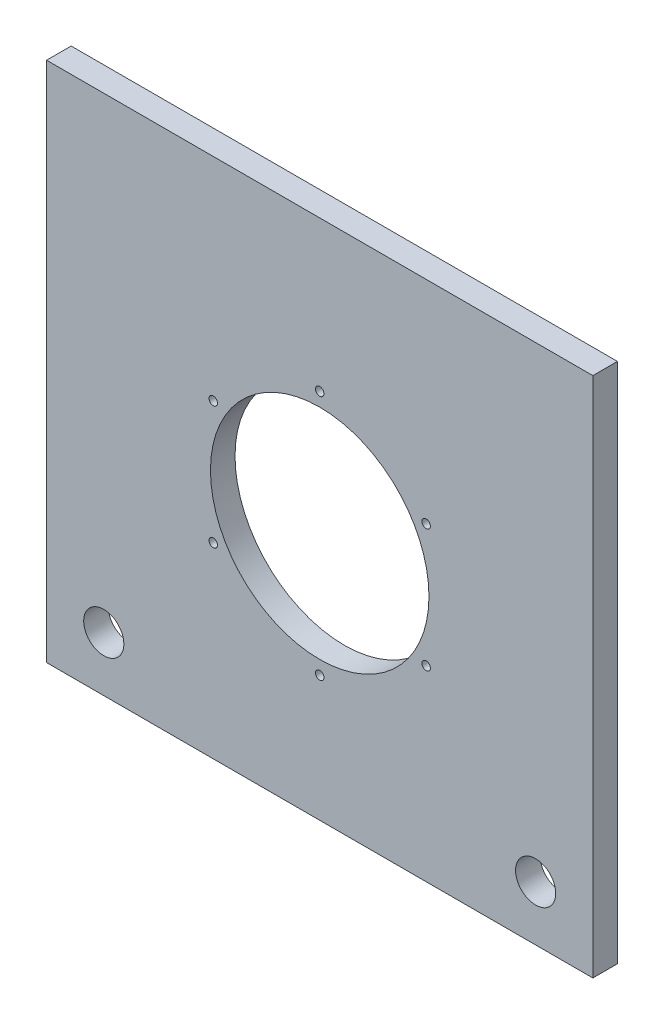
ISO-10303-21;
HEADER;
FILE_DESCRIPTION(('STEP AP214'),'2;1');
FILE_NAME('part.step','',(''),(''),'','','');
FILE_SCHEMA(('AUTOMOTIVE_DESIGN { 1 0 10303 214 1 1 1 1 }'));
ENDSEC;
DATA;
#1=APPLICATION_CONTEXT('core data for automotive mechanical design processes');
#2=APPLICATION_PROTOCOL_DEFINITION('international standard','automotive_design',2000,#1);
#3=PRODUCT_CONTEXT('',#1,'mechanical');
#4=PRODUCT('Part','Part','',(#3));
#5=PRODUCT_RELATED_PRODUCT_CATEGORY('part','',(#4));
#6=PRODUCT_DEFINITION_FORMATION('','',#4);
#7=PRODUCT_DEFINITION_CONTEXT('part definition',#1,'design');
#8=PRODUCT_DEFINITION('design','',#6,#7);
#9=PRODUCT_DEFINITION_SHAPE('','',#8);
#10=(LENGTH_UNIT() NAMED_UNIT(*) SI_UNIT(.MILLI.,.METRE.));
#11=(NAMED_UNIT(*) PLANE_ANGLE_UNIT() SI_UNIT($,.RADIAN.));
#12=(NAMED_UNIT(*) SI_UNIT($,.STERADIAN.) SOLID_ANGLE_UNIT());
#13=UNCERTAINTY_MEASURE_WITH_UNIT(LENGTH_MEASURE(1.E-05),#10,'distance_accuracy_value','');
#14=(GEOMETRIC_REPRESENTATION_CONTEXT(3) GLOBAL_UNCERTAINTY_ASSIGNED_CONTEXT((#13)) GLOBAL_UNIT_ASSIGNED_CONTEXT((#10,
#11,#12)) REPRESENTATION_CONTEXT('',''));
#15=CARTESIAN_POINT('',(0.,0.,0.));
#16=DIRECTION('',(0.,0.,1.));
#17=DIRECTION('',(1.,0.,0.));
#18=AXIS2_PLACEMENT_3D('',#15,#16,#17);
#19=CARTESIAN_POINT('',(0.,0.,9.));
#20=DIRECTION('',(0.,0.,1.));
#21=DIRECTION('',(1.,0.,0.));
#22=AXIS2_PLACEMENT_3D('',#19,#20,#21);
#23=PLANE('',#22);
#24=CARTESIAN_POINT('',(-38.9711431702997,-27.,9.));
#25=DIRECTION('',(0.,0.,1.));
#26=DIRECTION('',(1.,0.,0.));
#27=AXIS2_PLACEMENT_3D('',#24,#25,#26);
#28=CIRCLE('',#27,1.54999999999999);
#29=CARTESIAN_POINT('',(-37.4211431702997,-27.,9.));
#30=VERTEX_POINT('',#29);
#31=EDGE_CURVE('E159',#30,#30,#28,.T.);
#32=ORIENTED_EDGE('',*,*,#31,.F.);
#33=EDGE_LOOP('',(#32));
#34=FACE_BOUND('',#33,.T.);
#35=CARTESIAN_POINT('',(38.9711431702997,-27.,9.));
#36=DIRECTION('',(0.,0.,1.));
#37=DIRECTION('',(1.,0.,0.));
#38=AXIS2_PLACEMENT_3D('',#35,#36,#37);
#39=CIRCLE('',#38,1.54999999999999);
#40=CARTESIAN_POINT('',(40.5211431702997,-27.,9.));
#41=VERTEX_POINT('',#40);
#42=EDGE_CURVE('E147',#41,#41,#39,.T.);
#43=ORIENTED_EDGE('',*,*,#42,.F.);
#44=EDGE_LOOP('',(#43));
#45=FACE_BOUND('',#44,.T.);
#46=CARTESIAN_POINT('',(0.,40.5,9.));
#47=DIRECTION('',(0.,0.,1.));
#48=DIRECTION('',(1.,0.,0.));
#49=AXIS2_PLACEMENT_3D('',#46,#47,#48);
#50=CIRCLE('',#49,1.55);
#51=CARTESIAN_POINT('',(1.55,40.5,9.));
#52=VERTEX_POINT('',#51);
#53=EDGE_CURVE('E135',#52,#52,#50,.T.);
#54=ORIENTED_EDGE('',*,*,#53,.F.);
#55=EDGE_LOOP('',(#54));
#56=FACE_BOUND('',#55,.T.);
#57=CARTESIAN_POINT('',(-79.0575916230366,-75.5,9.));
#58=DIRECTION('',(0.,0.,1.));
#59=DIRECTION('',(1.,0.,0.));
#60=AXIS2_PLACEMENT_3D('',#57,#58,#59);
#61=CIRCLE('',#60,7.34999999999999);
#62=CARTESIAN_POINT('',(-71.7075916230366,-75.5,9.));
#63=VERTEX_POINT('',#62);
#64=EDGE_CURVE('E123',#63,#63,#61,.T.);
#65=ORIENTED_EDGE('',*,*,#64,.F.);
#66=EDGE_LOOP('',(#65));
#67=FACE_BOUND('',#66,.T.);
#68=DIRECTION('',(0.,1.,0.));
#69=VECTOR('',#68,1.);
#70=CARTESIAN_POINT('',(100.,95.5,9.));
#71=LINE('',#70,#69);
#72=CARTESIAN_POINT('',(100.,-95.5,9.));
#73=VERTEX_POINT('',#72);
#74=CARTESIAN_POINT('',(100.,95.5,9.));
#75=VERTEX_POINT('',#74);
#76=EDGE_CURVE('E93',#73,#75,#71,.T.);
#77=ORIENTED_EDGE('',*,*,#76,.T.);
#78=DIRECTION('',(-1.,0.,0.));
#79=VECTOR('',#78,1.);
#80=CARTESIAN_POINT('',(-100.,95.5,9.));
#81=LINE('',#80,#79);
#82=CARTESIAN_POINT('',(-100.,95.5,9.));
#83=VERTEX_POINT('',#82);
#84=EDGE_CURVE('E88',#75,#83,#81,.T.);
#85=ORIENTED_EDGE('',*,*,#84,.T.);
#86=DIRECTION('',(0.,-1.,0.));
#87=VECTOR('',#86,1.);
#88=CARTESIAN_POINT('',(-100.,95.5,9.));
#89=LINE('',#88,#87);
#90=CARTESIAN_POINT('',(-100.,-95.5,9.));
#91=VERTEX_POINT('',#90);
#92=EDGE_CURVE('E91',#83,#91,#89,.T.);
#93=ORIENTED_EDGE('',*,*,#92,.T.);
#94=DIRECTION('',(1.,0.,0.));
#95=VECTOR('',#94,1.);
#96=CARTESIAN_POINT('',(-100.,-95.5,9.));
#97=LINE('',#96,#95);
#98=EDGE_CURVE('E58',#91,#73,#97,.T.);
#99=ORIENTED_EDGE('',*,*,#98,.T.);
#100=EDGE_LOOP('',(#77,#85,#93,#99));
#101=FACE_BOUND('',#100,.T.);
#102=CARTESIAN_POINT('',(0.,-4.5,9.));
#103=DIRECTION('',(0.,0.,1.));
#104=DIRECTION('',(1.,0.,0.));
#105=AXIS2_PLACEMENT_3D('',#102,#103,#104);
#106=CIRCLE('',#105,40.);
#107=CARTESIAN_POINT('',(40.,-4.5,9.));
#108=VERTEX_POINT('',#107);
#109=EDGE_CURVE('E108',#108,#108,#106,.T.);
#110=ORIENTED_EDGE('',*,*,#109,.F.);
#111=EDGE_LOOP('',(#110));
#112=FACE_BOUND('',#111,.T.);
#113=CARTESIAN_POINT('',(79.0575916230372,-75.4999999999996,9.));
#114=DIRECTION('',(0.,0.,1.));
#115=DIRECTION('',(-1.,0.,0.));
#116=AXIS2_PLACEMENT_3D('',#113,#114,#115);
#117=CIRCLE('',#116,7.34999999999999);
#118=CARTESIAN_POINT('',(71.7075916230372,-75.4999999999996,9.));
#119=VERTEX_POINT('',#118);
#120=EDGE_CURVE('E129',#119,#119,#117,.T.);
#121=ORIENTED_EDGE('',*,*,#120,.F.);
#122=EDGE_LOOP('',(#121));
#123=FACE_BOUND('',#122,.T.);
#124=CARTESIAN_POINT('',(38.9711431702997,18.,9.));
#125=DIRECTION('',(0.,0.,1.));
#126=DIRECTION('',(1.,0.,0.));
#127=AXIS2_PLACEMENT_3D('',#124,#125,#126);
#128=CIRCLE('',#127,1.55000000000001);
#129=CARTESIAN_POINT('',(40.5211431702998,18.,9.));
#130=VERTEX_POINT('',#129);
#131=EDGE_CURVE('E141',#130,#130,#128,.T.);
#132=ORIENTED_EDGE('',*,*,#131,.F.);
#133=EDGE_LOOP('',(#132));
#134=FACE_BOUND('',#133,.T.);
#135=CARTESIAN_POINT('',(0.,-49.5,9.));
#136=DIRECTION('',(0.,0.,1.));
#137=DIRECTION('',(1.,0.,0.));
#138=AXIS2_PLACEMENT_3D('',#135,#136,#137);
#139=CIRCLE('',#138,1.55);
#140=CARTESIAN_POINT('',(1.55000000000001,-49.5,9.));
#141=VERTEX_POINT('',#140);
#142=EDGE_CURVE('E153',#141,#141,#139,.T.);
#143=ORIENTED_EDGE('',*,*,#142,.F.);
#144=EDGE_LOOP('',(#143));
#145=FACE_BOUND('',#144,.T.);
#146=CARTESIAN_POINT('',(-38.9711431702997,18.,9.));
#147=DIRECTION('',(0.,0.,1.));
#148=DIRECTION('',(1.,0.,0.));
#149=AXIS2_PLACEMENT_3D('',#146,#147,#148);
#150=CIRCLE('',#149,1.55);
#151=CARTESIAN_POINT('',(-37.4211431702997,18.,9.));
#152=VERTEX_POINT('',#151);
#153=EDGE_CURVE('E165',#152,#152,#150,.T.);
#154=ORIENTED_EDGE('',*,*,#153,.F.);
#155=EDGE_LOOP('',(#154));
#156=FACE_BOUND('',#155,.T.);
#157=ADVANCED_FACE('F41',(#34,#45,#56,#67,#101,#112,#123,#134,#145,#156),#23,.T.);
#158=CARTESIAN_POINT('',(0.,0.,0.));
#159=DIRECTION('',(0.,0.,1.));
#160=DIRECTION('',(1.,0.,0.));
#161=AXIS2_PLACEMENT_3D('',#158,#159,#160);
#162=PLANE('',#161);
#163=DIRECTION('',(0.,1.,0.));
#164=VECTOR('',#163,1.);
#165=CARTESIAN_POINT('',(100.,95.5,0.));
#166=LINE('',#165,#164);
#167=CARTESIAN_POINT('',(100.,-95.5,0.));
#168=VERTEX_POINT('',#167);
#169=CARTESIAN_POINT('',(100.,95.5,0.));
#170=VERTEX_POINT('',#169);
#171=EDGE_CURVE('E105',#168,#170,#166,.T.);
#172=ORIENTED_EDGE('',*,*,#171,.F.);
#173=DIRECTION('',(1.,0.,0.));
#174=VECTOR('',#173,1.);
#175=CARTESIAN_POINT('',(-100.,-95.5,0.));
#176=LINE('',#175,#174);
#177=CARTESIAN_POINT('',(-100.,-95.5,0.));
#178=VERTEX_POINT('',#177);
#179=EDGE_CURVE('E81',#178,#168,#176,.T.);
#180=ORIENTED_EDGE('',*,*,#179,.F.);
#181=DIRECTION('',(0.,-1.,0.));
#182=VECTOR('',#181,1.);
#183=CARTESIAN_POINT('',(-100.,95.5,0.));
#184=LINE('',#183,#182);
#185=CARTESIAN_POINT('',(-100.,95.5,0.));
#186=VERTEX_POINT('',#185);
#187=EDGE_CURVE('E75',#186,#178,#184,.T.);
#188=ORIENTED_EDGE('',*,*,#187,.F.);
#189=DIRECTION('',(-1.,0.,0.));
#190=VECTOR('',#189,1.);
#191=CARTESIAN_POINT('',(-100.,95.5,0.));
#192=LINE('',#191,#190);
#193=EDGE_CURVE('E97',#170,#186,#192,.T.);
#194=ORIENTED_EDGE('',*,*,#193,.F.);
#195=EDGE_LOOP('',(#172,#180,#188,#194));
#196=FACE_BOUND('',#195,.T.);
#197=CARTESIAN_POINT('',(0.,-4.5,0.));
#198=DIRECTION('',(0.,0.,1.));
#199=DIRECTION('',(1.,0.,0.));
#200=AXIS2_PLACEMENT_3D('',#197,#198,#199);
#201=CIRCLE('',#200,40.);
#202=CARTESIAN_POINT('',(40.,-4.5,0.));
#203=VERTEX_POINT('',#202);
#204=EDGE_CURVE('E120',#203,#203,#201,.T.);
#205=ORIENTED_EDGE('',*,*,#204,.T.);
#206=EDGE_LOOP('',(#205));
#207=FACE_BOUND('',#206,.T.);
#208=CARTESIAN_POINT('',(-79.0575916230366,-75.5,0.));
#209=DIRECTION('',(0.,0.,1.));
#210=DIRECTION('',(1.,0.,0.));
#211=AXIS2_PLACEMENT_3D('',#208,#209,#210);
#212=CIRCLE('',#211,7.34999999999999);
#213=CARTESIAN_POINT('',(-71.7075916230366,-75.5,0.));
#214=VERTEX_POINT('',#213);
#215=EDGE_CURVE('E126',#214,#214,#212,.T.);
#216=ORIENTED_EDGE('',*,*,#215,.T.);
#217=EDGE_LOOP('',(#216));
#218=FACE_BOUND('',#217,.T.);
#219=CARTESIAN_POINT('',(79.0575916230372,-75.4999999999996,0.));
#220=DIRECTION('',(0.,0.,1.));
#221=DIRECTION('',(-1.,0.,0.));
#222=AXIS2_PLACEMENT_3D('',#219,#220,#221);
#223=CIRCLE('',#222,7.34999999999999);
#224=CARTESIAN_POINT('',(71.7075916230372,-75.4999999999996,0.));
#225=VERTEX_POINT('',#224);
#226=EDGE_CURVE('E132',#225,#225,#223,.T.);
#227=ORIENTED_EDGE('',*,*,#226,.T.);
#228=EDGE_LOOP('',(#227));
#229=FACE_BOUND('',#228,.T.);
#230=CARTESIAN_POINT('',(0.,40.5,0.));
#231=DIRECTION('',(0.,0.,1.));
#232=DIRECTION('',(1.,0.,0.));
#233=AXIS2_PLACEMENT_3D('',#230,#231,#232);
#234=CIRCLE('',#233,1.55);
#235=CARTESIAN_POINT('',(1.55,40.5,0.));
#236=VERTEX_POINT('',#235);
#237=EDGE_CURVE('E138',#236,#236,#234,.T.);
#238=ORIENTED_EDGE('',*,*,#237,.T.);
#239=EDGE_LOOP('',(#238));
#240=FACE_BOUND('',#239,.T.);
#241=CARTESIAN_POINT('',(38.9711431702997,18.,0.));
#242=DIRECTION('',(0.,0.,1.));
#243=DIRECTION('',(1.,0.,0.));
#244=AXIS2_PLACEMENT_3D('',#241,#242,#243);
#245=CIRCLE('',#244,1.55000000000001);
#246=CARTESIAN_POINT('',(40.5211431702998,18.,0.));
#247=VERTEX_POINT('',#246);
#248=EDGE_CURVE('E144',#247,#247,#245,.T.);
#249=ORIENTED_EDGE('',*,*,#248,.T.);
#250=EDGE_LOOP('',(#249));
#251=FACE_BOUND('',#250,.T.);
#252=CARTESIAN_POINT('',(38.9711431702997,-27.,0.));
#253=DIRECTION('',(0.,0.,1.));
#254=DIRECTION('',(1.,0.,0.));
#255=AXIS2_PLACEMENT_3D('',#252,#253,#254);
#256=CIRCLE('',#255,1.54999999999999);
#257=CARTESIAN_POINT('',(40.5211431702997,-27.,0.));
#258=VERTEX_POINT('',#257);
#259=EDGE_CURVE('E150',#258,#258,#256,.T.);
#260=ORIENTED_EDGE('',*,*,#259,.T.);
#261=EDGE_LOOP('',(#260));
#262=FACE_BOUND('',#261,.T.);
#263=CARTESIAN_POINT('',(0.,-49.5,0.));
#264=DIRECTION('',(0.,0.,1.));
#265=DIRECTION('',(1.,0.,0.));
#266=AXIS2_PLACEMENT_3D('',#263,#264,#265);
#267=CIRCLE('',#266,1.55);
#268=CARTESIAN_POINT('',(1.55000000000001,-49.5,0.));
#269=VERTEX_POINT('',#268);
#270=EDGE_CURVE('E156',#269,#269,#267,.T.);
#271=ORIENTED_EDGE('',*,*,#270,.T.);
#272=EDGE_LOOP('',(#271));
#273=FACE_BOUND('',#272,.T.);
#274=CARTESIAN_POINT('',(-38.9711431702997,-27.,0.));
#275=DIRECTION('',(0.,0.,1.));
#276=DIRECTION('',(1.,0.,0.));
#277=AXIS2_PLACEMENT_3D('',#274,#275,#276);
#278=CIRCLE('',#277,1.54999999999999);
#279=CARTESIAN_POINT('',(-37.4211431702997,-27.,0.));
#280=VERTEX_POINT('',#279);
#281=EDGE_CURVE('E162',#280,#280,#278,.T.);
#282=ORIENTED_EDGE('',*,*,#281,.T.);
#283=EDGE_LOOP('',(#282));
#284=FACE_BOUND('',#283,.T.);
#285=CARTESIAN_POINT('',(-38.9711431702997,18.,0.));
#286=DIRECTION('',(0.,0.,1.));
#287=DIRECTION('',(1.,0.,0.));
#288=AXIS2_PLACEMENT_3D('',#285,#286,#287);
#289=CIRCLE('',#288,1.55);
#290=CARTESIAN_POINT('',(-37.4211431702997,18.,0.));
#291=VERTEX_POINT('',#290);
#292=EDGE_CURVE('E168',#291,#291,#289,.T.);
#293=ORIENTED_EDGE('',*,*,#292,.T.);
#294=EDGE_LOOP('',(#293));
#295=FACE_BOUND('',#294,.T.);
#296=ADVANCED_FACE('F116',(#196,#207,#218,#229,#240,#251,#262,#273,#284,#295),#162,.F.);
#297=CARTESIAN_POINT('',(100.,95.5,9.));
#298=DIRECTION('',(-1.,0.,0.));
#299=DIRECTION('',(0.,-1.,0.));
#300=AXIS2_PLACEMENT_3D('',#297,#298,#299);
#301=PLANE('',#300);
#302=ORIENTED_EDGE('',*,*,#171,.T.);
#303=DIRECTION('',(0.,0.,-1.));
#304=VECTOR('',#303,1.);
#305=CARTESIAN_POINT('',(100.,95.5,9.));
#306=LINE('',#305,#304);
#307=EDGE_CURVE('E11',#75,#170,#306,.T.);
#308=ORIENTED_EDGE('',*,*,#307,.F.);
#309=ORIENTED_EDGE('',*,*,#76,.F.);
#310=DIRECTION('',(0.,0.,-1.));
#311=VECTOR('',#310,1.);
#312=CARTESIAN_POINT('',(100.,-95.5,9.));
#313=LINE('',#312,#311);
#314=EDGE_CURVE('E101',#73,#168,#313,.T.);
#315=ORIENTED_EDGE('',*,*,#314,.T.);
#316=EDGE_LOOP('',(#302,#308,#309,#315));
#317=FACE_BOUND('',#316,.T.);
#318=ADVANCED_FACE('F43',(#317),#301,.F.);
#319=CARTESIAN_POINT('',(-100.,95.5,9.));
#320=DIRECTION('',(0.,-1.,0.));
#321=DIRECTION('',(0.,0.,-1.));
#322=AXIS2_PLACEMENT_3D('',#319,#320,#321);
#323=PLANE('',#322);
#324=ORIENTED_EDGE('',*,*,#193,.T.);
#325=DIRECTION('',(0.,0.,-1.));
#326=VECTOR('',#325,1.);
#327=CARTESIAN_POINT('',(-100.,95.5,9.));
#328=LINE('',#327,#326);
#329=EDGE_CURVE('E50',#83,#186,#328,.T.);
#330=ORIENTED_EDGE('',*,*,#329,.F.);
#331=ORIENTED_EDGE('',*,*,#84,.F.);
#332=ORIENTED_EDGE('',*,*,#307,.T.);
#333=EDGE_LOOP('',(#324,#330,#331,#332));
#334=FACE_BOUND('',#333,.T.);
#335=ADVANCED_FACE('F96',(#334),#323,.F.);
#336=CARTESIAN_POINT('',(-100.,95.5,9.));
#337=DIRECTION('',(1.,0.,0.));
#338=DIRECTION('',(0.,1.,0.));
#339=AXIS2_PLACEMENT_3D('',#336,#337,#338);
#340=PLANE('',#339);
#341=ORIENTED_EDGE('',*,*,#187,.T.);
#342=DIRECTION('',(0.,0.,-1.));
#343=VECTOR('',#342,1.);
#344=CARTESIAN_POINT('',(-100.,-95.5,9.));
#345=LINE('',#344,#343);
#346=EDGE_CURVE('E98',#91,#178,#345,.T.);
#347=ORIENTED_EDGE('',*,*,#346,.F.);
#348=ORIENTED_EDGE('',*,*,#92,.F.);
#349=ORIENTED_EDGE('',*,*,#329,.T.);
#350=EDGE_LOOP('',(#341,#347,#348,#349));
#351=FACE_BOUND('',#350,.T.);
#352=ADVANCED_FACE('F99',(#351),#340,.F.);
#353=CARTESIAN_POINT('',(-100.,-95.5,9.));
#354=DIRECTION('',(0.,1.,0.));
#355=DIRECTION('',(0.,0.,1.));
#356=AXIS2_PLACEMENT_3D('',#353,#354,#355);
#357=PLANE('',#356);
#358=ORIENTED_EDGE('',*,*,#179,.T.);
#359=ORIENTED_EDGE('',*,*,#314,.F.);
#360=ORIENTED_EDGE('',*,*,#98,.F.);
#361=ORIENTED_EDGE('',*,*,#346,.T.);
#362=EDGE_LOOP('',(#358,#359,#360,#361));
#363=FACE_BOUND('',#362,.T.);
#364=ADVANCED_FACE('F113',(#363),#357,.F.);
#365=CARTESIAN_POINT('',(0.,-4.5,9.));
#366=DIRECTION('',(0.,0.,-1.));
#367=DIRECTION('',(-1.,0.,0.));
#368=AXIS2_PLACEMENT_3D('',#365,#366,#367);
#369=CYLINDRICAL_SURFACE('',#368,40.);
#370=ORIENTED_EDGE('',*,*,#109,.T.);
#371=EDGE_LOOP('',(#370));
#372=FACE_BOUND('',#371,.T.);
#373=ORIENTED_EDGE('',*,*,#204,.F.);
#374=EDGE_LOOP('',(#373));
#375=FACE_BOUND('',#374,.T.);
#376=ADVANCED_FACE('F187',(#372,#375),#369,.F.);
#377=CARTESIAN_POINT('',(-79.0575916230366,-75.5,9.));
#378=DIRECTION('',(0.,0.,-1.));
#379=DIRECTION('',(-1.,0.,0.));
#380=AXIS2_PLACEMENT_3D('',#377,#378,#379);
#381=CYLINDRICAL_SURFACE('',#380,7.34999999999999);
#382=ORIENTED_EDGE('',*,*,#64,.T.);
#383=EDGE_LOOP('',(#382));
#384=FACE_BOUND('',#383,.T.);
#385=ORIENTED_EDGE('',*,*,#215,.F.);
#386=EDGE_LOOP('',(#385));
#387=FACE_BOUND('',#386,.T.);
#388=ADVANCED_FACE('F232',(#384,#387),#381,.F.);
#389=CARTESIAN_POINT('',(79.0575916230372,-75.4999999999996,9.));
#390=DIRECTION('',(0.,0.,-1.));
#391=DIRECTION('',(-1.,0.,0.));
#392=AXIS2_PLACEMENT_3D('',#389,#390,#391);
#393=CYLINDRICAL_SURFACE('',#392,7.34999999999999);
#394=ORIENTED_EDGE('',*,*,#120,.T.);
#395=EDGE_LOOP('',(#394));
#396=FACE_BOUND('',#395,.T.);
#397=ORIENTED_EDGE('',*,*,#226,.F.);
#398=EDGE_LOOP('',(#397));
#399=FACE_BOUND('',#398,.T.);
#400=ADVANCED_FACE('F240',(#396,#399),#393,.F.);
#401=CARTESIAN_POINT('',(0.,40.5,9.));
#402=DIRECTION('',(0.,0.,-1.));
#403=DIRECTION('',(-1.,0.,0.));
#404=AXIS2_PLACEMENT_3D('',#401,#402,#403);
#405=CYLINDRICAL_SURFACE('',#404,1.55);
#406=ORIENTED_EDGE('',*,*,#53,.T.);
#407=EDGE_LOOP('',(#406));
#408=FACE_BOUND('',#407,.T.);
#409=ORIENTED_EDGE('',*,*,#237,.F.);
#410=EDGE_LOOP('',(#409));
#411=FACE_BOUND('',#410,.T.);
#412=ADVANCED_FACE('F248',(#408,#411),#405,.F.);
#413=CARTESIAN_POINT('',(38.9711431702997,18.,9.));
#414=DIRECTION('',(0.,0.,-1.));
#415=DIRECTION('',(-1.,0.,0.));
#416=AXIS2_PLACEMENT_3D('',#413,#414,#415);
#417=CYLINDRICAL_SURFACE('',#416,1.55000000000001);
#418=ORIENTED_EDGE('',*,*,#131,.T.);
#419=EDGE_LOOP('',(#418));
#420=FACE_BOUND('',#419,.T.);
#421=ORIENTED_EDGE('',*,*,#248,.F.);
#422=EDGE_LOOP('',(#421));
#423=FACE_BOUND('',#422,.T.);
#424=ADVANCED_FACE('F257',(#420,#423),#417,.F.);
#425=CARTESIAN_POINT('',(38.9711431702997,-27.,9.));
#426=DIRECTION('',(0.,0.,-1.));
#427=DIRECTION('',(-1.,0.,0.));
#428=AXIS2_PLACEMENT_3D('',#425,#426,#427);
#429=CYLINDRICAL_SURFACE('',#428,1.54999999999999);
#430=ORIENTED_EDGE('',*,*,#42,.T.);
#431=EDGE_LOOP('',(#430));
#432=FACE_BOUND('',#431,.T.);
#433=ORIENTED_EDGE('',*,*,#259,.F.);
#434=EDGE_LOOP('',(#433));
#435=FACE_BOUND('',#434,.T.);
#436=ADVANCED_FACE('F266',(#432,#435),#429,.F.);
#437=CARTESIAN_POINT('',(0.,-49.5,9.));
#438=DIRECTION('',(0.,0.,-1.));
#439=DIRECTION('',(-1.,0.,0.));
#440=AXIS2_PLACEMENT_3D('',#437,#438,#439);
#441=CYLINDRICAL_SURFACE('',#440,1.55);
#442=ORIENTED_EDGE('',*,*,#142,.T.);
#443=EDGE_LOOP('',(#442));
#444=FACE_BOUND('',#443,.T.);
#445=ORIENTED_EDGE('',*,*,#270,.F.);
#446=EDGE_LOOP('',(#445));
#447=FACE_BOUND('',#446,.T.);
#448=ADVANCED_FACE('F275',(#444,#447),#441,.F.);
#449=CARTESIAN_POINT('',(-38.9711431702997,-27.,9.));
#450=DIRECTION('',(0.,0.,-1.));
#451=DIRECTION('',(-1.,0.,0.));
#452=AXIS2_PLACEMENT_3D('',#449,#450,#451);
#453=CYLINDRICAL_SURFACE('',#452,1.54999999999999);
#454=ORIENTED_EDGE('',*,*,#31,.T.);
#455=EDGE_LOOP('',(#454));
#456=FACE_BOUND('',#455,.T.);
#457=ORIENTED_EDGE('',*,*,#281,.F.);
#458=EDGE_LOOP('',(#457));
#459=FACE_BOUND('',#458,.T.);
#460=ADVANCED_FACE('F284',(#456,#459),#453,.F.);
#461=CARTESIAN_POINT('',(-38.9711431702997,18.,9.));
#462=DIRECTION('',(0.,0.,-1.));
#463=DIRECTION('',(-1.,0.,0.));
#464=AXIS2_PLACEMENT_3D('',#461,#462,#463);
#465=CYLINDRICAL_SURFACE('',#464,1.55);
#466=ORIENTED_EDGE('',*,*,#153,.T.);
#467=EDGE_LOOP('',(#466));
#468=FACE_BOUND('',#467,.T.);
#469=ORIENTED_EDGE('',*,*,#292,.F.);
#470=EDGE_LOOP('',(#469));
#471=FACE_BOUND('',#470,.T.);
#472=ADVANCED_FACE('F174',(#468,#471),#465,.F.);
#473=CLOSED_SHELL('',(#157,#296,#318,#335,#352,#364,#376,#388,#400,#412,#424,#436,#448,#460,#472));
#474=MANIFOLD_SOLID_BREP('B2',#473);
#475=ADVANCED_BREP_SHAPE_REPRESENTATION('',(#18,#474),#14);
#476=SHAPE_DEFINITION_REPRESENTATION(#9,#475);
ENDSEC;
END-ISO-10303-21;
